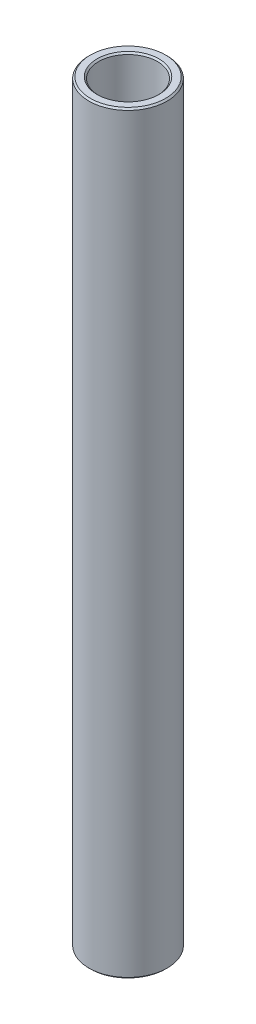
ISO-10303-21;
HEADER;
FILE_DESCRIPTION(('STEP AP214'),'2;1');
FILE_NAME('part.step','',(''),(''),'','','');
FILE_SCHEMA(('AUTOMOTIVE_DESIGN { 1 0 10303 214 1 1 1 1 }'));
ENDSEC;
DATA;
#1=APPLICATION_CONTEXT('core data for automotive mechanical design processes');
#2=APPLICATION_PROTOCOL_DEFINITION('international standard','automotive_design',2000,#1);
#3=PRODUCT_CONTEXT('',#1,'mechanical');
#4=PRODUCT('Part','Part','',(#3));
#5=PRODUCT_RELATED_PRODUCT_CATEGORY('part','',(#4));
#6=PRODUCT_DEFINITION_FORMATION('','',#4);
#7=PRODUCT_DEFINITION_CONTEXT('part definition',#1,'design');
#8=PRODUCT_DEFINITION('design','',#6,#7);
#9=PRODUCT_DEFINITION_SHAPE('','',#8);
#10=(LENGTH_UNIT() NAMED_UNIT(*) SI_UNIT(.MILLI.,.METRE.));
#11=(NAMED_UNIT(*) PLANE_ANGLE_UNIT() SI_UNIT($,.RADIAN.));
#12=(NAMED_UNIT(*) SI_UNIT($,.STERADIAN.) SOLID_ANGLE_UNIT());
#13=UNCERTAINTY_MEASURE_WITH_UNIT(LENGTH_MEASURE(1.E-05),#10,'distance_accuracy_value','');
#14=(GEOMETRIC_REPRESENTATION_CONTEXT(3) GLOBAL_UNCERTAINTY_ASSIGNED_CONTEXT((#13)) GLOBAL_UNIT_ASSIGNED_CONTEXT((#10,
#11,#12)) REPRESENTATION_CONTEXT('',''));
#15=CARTESIAN_POINT('',(0.,0.,0.));
#16=DIRECTION('',(0.,0.,1.));
#17=DIRECTION('',(1.,0.,0.));
#18=AXIS2_PLACEMENT_3D('',#15,#16,#17);
#19=CARTESIAN_POINT('',(6.35000000000028,131.762389929629,0.));
#20=DIRECTION('',(0.,-1.,0.));
#21=DIRECTION('',(1.,0.,0.));
#22=AXIS2_PLACEMENT_3D('',#19,#20,#21);
#23=PLANE('',#22);
#24=CARTESIAN_POINT('',(0.,131.762389929629,0.));
#25=DIRECTION('',(0.,-1.,0.));
#26=DIRECTION('',(1.,0.,0.));
#27=AXIS2_PLACEMENT_3D('',#24,#25,#26);
#28=CIRCLE('',#27,5.01650000000007);
#29=CARTESIAN_POINT('',(5.01650000000003,131.762389929629,0.));
#30=VERTEX_POINT('',#29);
#31=EDGE_CURVE('E10',#30,#30,#28,.F.);
#32=ORIENTED_EDGE('',*,*,#31,.T.);
#33=EDGE_LOOP('',(#32));
#34=FACE_BOUND('',#33,.T.);
#35=CARTESIAN_POINT('',(0.,131.762389929629,0.));
#36=DIRECTION('',(0.,-1.,0.));
#37=DIRECTION('',(1.,0.,0.));
#38=AXIS2_PLACEMENT_3D('',#35,#36,#37);
#39=CIRCLE('',#38,6.09600000000032);
#40=CARTESIAN_POINT('',(6.09600000000028,131.762389929629,0.));
#41=VERTEX_POINT('',#40);
#42=EDGE_CURVE('E38',#41,#41,#39,.T.);
#43=ORIENTED_EDGE('',*,*,#42,.T.);
#44=EDGE_LOOP('',(#43));
#45=FACE_BOUND('',#44,.T.);
#46=ADVANCED_FACE('F31',(#34,#45),#23,.T.);
#47=CARTESIAN_POINT('',(0.,122.237389929629,0.));
#48=DIRECTION('',(0.,-1.,0.));
#49=DIRECTION('',(1.,0.,0.));
#50=AXIS2_PLACEMENT_3D('',#47,#48,#49);
#51=CYLINDRICAL_SURFACE('',#50,4.76250000000033);
#52=CARTESIAN_POINT('',(-5.94193857662584E-13,253.745889929628,0.));
#53=DIRECTION('',(0.,1.,0.));
#54=DIRECTION('',(-1.,0.,0.));
#55=AXIS2_PLACEMENT_3D('',#52,#53,#54);
#56=CIRCLE('',#55,4.76250000000033);
#57=CARTESIAN_POINT('',(-4.76250000000093,253.745889929628,0.));
#58=VERTEX_POINT('',#57);
#59=EDGE_CURVE('E42',#58,#58,#56,.T.);
#60=ORIENTED_EDGE('',*,*,#59,.T.);
#61=EDGE_LOOP('',(#60));
#62=FACE_BOUND('',#61,.T.);
#63=CARTESIAN_POINT('',(0.,132.016389929628,0.));
#64=DIRECTION('',(0.,-1.,0.));
#65=DIRECTION('',(1.,0.,0.));
#66=AXIS2_PLACEMENT_3D('',#63,#64,#65);
#67=CIRCLE('',#66,4.76250000000033);
#68=CARTESIAN_POINT('',(4.76250000000029,132.016389929628,0.));
#69=VERTEX_POINT('',#68);
#70=EDGE_CURVE('E46',#69,#69,#67,.T.);
#71=ORIENTED_EDGE('',*,*,#70,.T.);
#72=EDGE_LOOP('',(#71));
#73=FACE_BOUND('',#72,.T.);
#74=ADVANCED_FACE('F75',(#62,#73),#51,.F.);
#75=CARTESIAN_POINT('',(4.76250000000001,253.999889929629,0.));
#76=DIRECTION('',(0.,1.,0.));
#77=DIRECTION('',(-1.,0.,0.));
#78=AXIS2_PLACEMENT_3D('',#75,#76,#77);
#79=PLANE('',#78);
#80=CARTESIAN_POINT('',(-5.95341503935231E-13,253.999889929629,0.));
#81=DIRECTION('',(0.,1.,0.));
#82=DIRECTION('',(-1.,0.,0.));
#83=AXIS2_PLACEMENT_3D('',#80,#81,#82);
#84=CIRCLE('',#83,6.09600000000094);
#85=CARTESIAN_POINT('',(-6.09600000000153,253.999889929629,0.));
#86=VERTEX_POINT('',#85);
#87=EDGE_CURVE('E51',#86,#86,#84,.T.);
#88=ORIENTED_EDGE('',*,*,#87,.T.);
#89=EDGE_LOOP('',(#88));
#90=FACE_BOUND('',#89,.T.);
#91=CARTESIAN_POINT('',(-5.95341503935231E-13,253.999889929629,0.));
#92=DIRECTION('',(0.,1.,0.));
#93=DIRECTION('',(-1.,0.,0.));
#94=AXIS2_PLACEMENT_3D('',#91,#92,#93);
#95=CIRCLE('',#94,5.01650000000057);
#96=CARTESIAN_POINT('',(-5.01650000000116,253.999889929629,0.));
#97=VERTEX_POINT('',#96);
#98=EDGE_CURVE('E54',#97,#97,#95,.F.);
#99=ORIENTED_EDGE('',*,*,#98,.T.);
#100=EDGE_LOOP('',(#99));
#101=FACE_BOUND('',#100,.T.);
#102=ADVANCED_FACE('F80',(#90,#101),#79,.T.);
#103=CARTESIAN_POINT('',(0.,122.237389929629,0.));
#104=DIRECTION('',(0.,-1.,0.));
#105=DIRECTION('',(1.,0.,0.));
#106=AXIS2_PLACEMENT_3D('',#103,#104,#105);
#107=CYLINDRICAL_SURFACE('',#106,6.3500000000006);
#108=CARTESIAN_POINT('',(-5.94193857662587E-13,253.745889929629,0.));
#109=DIRECTION('',(0.,1.,0.));
#110=DIRECTION('',(-1.,0.,0.));
#111=AXIS2_PLACEMENT_3D('',#108,#109,#110);
#112=CIRCLE('',#111,6.3500000000006);
#113=CARTESIAN_POINT('',(-6.3500000000012,253.745889929629,0.));
#114=VERTEX_POINT('',#113);
#115=EDGE_CURVE('E57',#114,#114,#112,.F.);
#116=ORIENTED_EDGE('',*,*,#115,.T.);
#117=EDGE_LOOP('',(#116));
#118=FACE_BOUND('',#117,.T.);
#119=CARTESIAN_POINT('',(0.,132.016389929629,0.));
#120=DIRECTION('',(0.,-1.,0.));
#121=DIRECTION('',(1.,0.,0.));
#122=AXIS2_PLACEMENT_3D('',#119,#120,#121);
#123=CIRCLE('',#122,6.3500000000006);
#124=CARTESIAN_POINT('',(6.35000000000056,132.016389929629,0.));
#125=VERTEX_POINT('',#124);
#126=EDGE_CURVE('E60',#125,#125,#123,.F.);
#127=ORIENTED_EDGE('',*,*,#126,.T.);
#128=EDGE_LOOP('',(#127));
#129=FACE_BOUND('',#128,.T.);
#130=ADVANCED_FACE('F64',(#118,#129),#107,.T.);
#131=CARTESIAN_POINT('',(-5.94193857662587E-13,253.745889929629,0.));
#132=DIRECTION('',(0.,-1.,0.));
#133=DIRECTION('',(1.,0.,0.));
#134=AXIS2_PLACEMENT_3D('',#131,#132,#133);
#135=CONICAL_SURFACE('',#134,6.3500000000006,0.785398163397532);
#136=ORIENTED_EDGE('',*,*,#87,.F.);
#137=EDGE_LOOP('',(#136));
#138=FACE_BOUND('',#137,.T.);
#139=ORIENTED_EDGE('',*,*,#115,.F.);
#140=EDGE_LOOP('',(#139));
#141=FACE_BOUND('',#140,.T.);
#142=ADVANCED_FACE('F85',(#138,#141),#135,.T.);
#143=CARTESIAN_POINT('',(-5.95341503935231E-13,253.999889929629,0.));
#144=DIRECTION('',(0.,1.,0.));
#145=DIRECTION('',(-1.,0.,0.));
#146=AXIS2_PLACEMENT_3D('',#143,#144,#145);
#147=CONICAL_SURFACE('',#146,5.01650000000059,0.785398163397344);
#148=ORIENTED_EDGE('',*,*,#59,.F.);
#149=EDGE_LOOP('',(#148));
#150=FACE_BOUND('',#149,.T.);
#151=ORIENTED_EDGE('',*,*,#98,.F.);
#152=EDGE_LOOP('',(#151));
#153=FACE_BOUND('',#152,.T.);
#154=ADVANCED_FACE('F72',(#150,#153),#147,.F.);
#155=CARTESIAN_POINT('',(0.,132.016389929628,0.));
#156=DIRECTION('',(0.,-1.,0.));
#157=DIRECTION('',(1.,0.,0.));
#158=AXIS2_PLACEMENT_3D('',#155,#156,#157);
#159=CONICAL_SURFACE('',#158,4.76250000000033,0.785398163397411);
#160=ORIENTED_EDGE('',*,*,#31,.F.);
#161=EDGE_LOOP('',(#160));
#162=FACE_BOUND('',#161,.T.);
#163=ORIENTED_EDGE('',*,*,#70,.F.);
#164=EDGE_LOOP('',(#163));
#165=FACE_BOUND('',#164,.T.);
#166=ADVANCED_FACE('F68',(#162,#165),#159,.F.);
#167=CARTESIAN_POINT('',(0.,131.762389929629,0.));
#168=DIRECTION('',(0.,1.,0.));
#169=DIRECTION('',(-1.,0.,0.));
#170=AXIS2_PLACEMENT_3D('',#167,#168,#169);
#171=CONICAL_SURFACE('',#170,6.09600000000032,0.785398163397385);
#172=ORIENTED_EDGE('',*,*,#126,.F.);
#173=EDGE_LOOP('',(#172));
#174=FACE_BOUND('',#173,.T.);
#175=ORIENTED_EDGE('',*,*,#42,.F.);
#176=EDGE_LOOP('',(#175));
#177=FACE_BOUND('',#176,.T.);
#178=ADVANCED_FACE('F33',(#174,#177),#171,.T.);
#179=CLOSED_SHELL('',(#46,#74,#102,#130,#142,#154,#166,#178));
#180=MANIFOLD_SOLID_BREP('B2',#179);
#181=ADVANCED_BREP_SHAPE_REPRESENTATION('',(#18,#180),#14);
#182=SHAPE_DEFINITION_REPRESENTATION(#9,#181);
ENDSEC;
END-ISO-10303-21;
